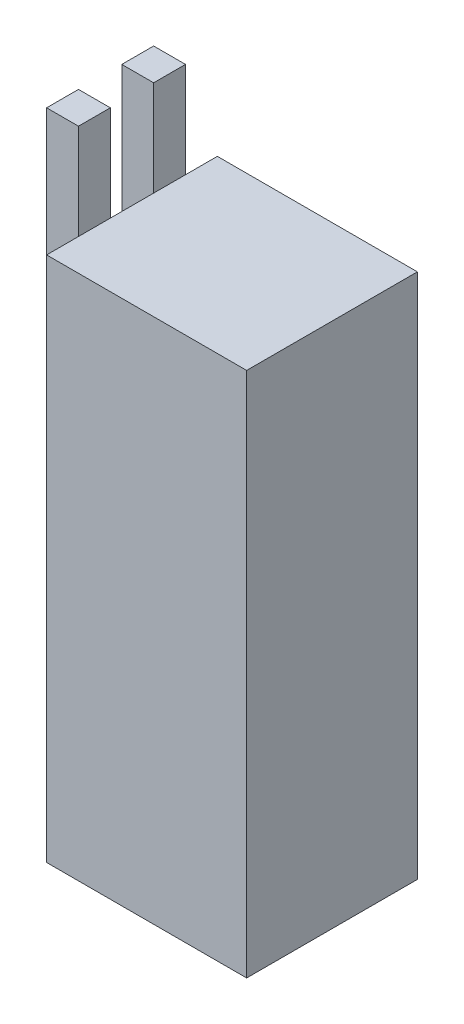
ISO-10303-21;
HEADER;
FILE_DESCRIPTION(('STEP AP214'),'2;1');
FILE_NAME('part.step','',(''),(''),'','','');
FILE_SCHEMA(('AUTOMOTIVE_DESIGN { 1 0 10303 214 1 1 1 1 }'));
ENDSEC;
DATA;
#1=APPLICATION_CONTEXT('core data for automotive mechanical design processes');
#2=APPLICATION_PROTOCOL_DEFINITION('international standard','automotive_design',2000,#1);
#3=PRODUCT_CONTEXT('',#1,'mechanical');
#4=PRODUCT('Part','Part','',(#3));
#5=PRODUCT_RELATED_PRODUCT_CATEGORY('part','',(#4));
#6=PRODUCT_DEFINITION_FORMATION('','',#4);
#7=PRODUCT_DEFINITION_CONTEXT('part definition',#1,'design');
#8=PRODUCT_DEFINITION('design','',#6,#7);
#9=PRODUCT_DEFINITION_SHAPE('','',#8);
#10=(LENGTH_UNIT() NAMED_UNIT(*) SI_UNIT(.MILLI.,.METRE.));
#11=(NAMED_UNIT(*) PLANE_ANGLE_UNIT() SI_UNIT($,.RADIAN.));
#12=(NAMED_UNIT(*) SI_UNIT($,.STERADIAN.) SOLID_ANGLE_UNIT());
#13=UNCERTAINTY_MEASURE_WITH_UNIT(LENGTH_MEASURE(1.E-05),#10,'distance_accuracy_value','');
#14=(GEOMETRIC_REPRESENTATION_CONTEXT(3) GLOBAL_UNCERTAINTY_ASSIGNED_CONTEXT((#13)) GLOBAL_UNIT_ASSIGNED_CONTEXT((#10,
#11,#12)) REPRESENTATION_CONTEXT('',''));
#15=CARTESIAN_POINT('',(0.,0.,0.));
#16=DIRECTION('',(0.,0.,1.));
#17=DIRECTION('',(1.,0.,0.));
#18=AXIS2_PLACEMENT_3D('',#15,#16,#17);
#19=CARTESIAN_POINT('',(19.939,104.902,17.018));
#20=DIRECTION('',(-1.,0.,0.));
#21=DIRECTION('',(0.,0.,1.));
#22=AXIS2_PLACEMENT_3D('',#19,#20,#21);
#23=PLANE('',#22);
#24=DIRECTION('',(0.,0.,-1.));
#25=VECTOR('',#24,1.);
#26=CARTESIAN_POINT('',(19.939,0.,17.018));
#27=LINE('',#26,#25);
#28=CARTESIAN_POINT('',(19.939,0.,17.018));
#29=VERTEX_POINT('',#28);
#30=CARTESIAN_POINT('',(19.939,0.,-17.018));
#31=VERTEX_POINT('',#30);
#32=EDGE_CURVE('E207',#29,#31,#27,.T.);
#33=ORIENTED_EDGE('',*,*,#32,.T.);
#34=DIRECTION('',(0.,-1.,0.));
#35=VECTOR('',#34,1.);
#36=CARTESIAN_POINT('',(19.939,104.902,-17.018));
#37=LINE('',#36,#35);
#38=CARTESIAN_POINT('',(19.939,104.902,-17.018));
#39=VERTEX_POINT('',#38);
#40=EDGE_CURVE('E38',#39,#31,#37,.T.);
#41=ORIENTED_EDGE('',*,*,#40,.F.);
#42=DIRECTION('',(0.,0.,-1.));
#43=VECTOR('',#42,1.);
#44=CARTESIAN_POINT('',(19.939,104.902,17.018));
#45=LINE('',#44,#43);
#46=CARTESIAN_POINT('',(19.939,104.902,17.018));
#47=VERTEX_POINT('',#46);
#48=EDGE_CURVE('E213',#47,#39,#45,.T.);
#49=ORIENTED_EDGE('',*,*,#48,.F.);
#50=DIRECTION('',(0.,-1.,0.));
#51=VECTOR('',#50,1.);
#52=CARTESIAN_POINT('',(19.939,104.902,17.018));
#53=LINE('',#52,#51);
#54=EDGE_CURVE('E226',#47,#29,#53,.T.);
#55=ORIENTED_EDGE('',*,*,#54,.T.);
#56=EDGE_LOOP('',(#33,#41,#49,#55));
#57=FACE_BOUND('',#56,.T.);
#58=ADVANCED_FACE('F35',(#57),#23,.F.);
#59=CARTESIAN_POINT('',(-19.939,104.902,-17.018));
#60=DIRECTION('',(0.,0.,1.));
#61=DIRECTION('',(1.,0.,0.));
#62=AXIS2_PLACEMENT_3D('',#59,#60,#61);
#63=PLANE('',#62);
#64=DIRECTION('',(-1.,0.,0.));
#65=VECTOR('',#64,1.);
#66=CARTESIAN_POINT('',(-19.939,0.,-17.018));
#67=LINE('',#66,#65);
#68=CARTESIAN_POINT('',(-19.939,0.,-17.018));
#69=VERTEX_POINT('',#68);
#70=EDGE_CURVE('E229',#31,#69,#67,.T.);
#71=ORIENTED_EDGE('',*,*,#70,.T.);
#72=DIRECTION('',(0.,-1.,0.));
#73=VECTOR('',#72,1.);
#74=CARTESIAN_POINT('',(-19.939,104.902,-17.018));
#75=LINE('',#74,#73);
#76=CARTESIAN_POINT('',(-19.939,104.902,-17.018));
#77=VERTEX_POINT('',#76);
#78=EDGE_CURVE('E238',#77,#69,#75,.T.);
#79=ORIENTED_EDGE('',*,*,#78,.F.);
#80=DIRECTION('',(-1.,0.,0.));
#81=VECTOR('',#80,1.);
#82=CARTESIAN_POINT('',(-19.939,104.902,-17.018));
#83=LINE('',#82,#81);
#84=EDGE_CURVE('E216',#39,#77,#83,.T.);
#85=ORIENTED_EDGE('',*,*,#84,.F.);
#86=ORIENTED_EDGE('',*,*,#40,.T.);
#87=EDGE_LOOP('',(#71,#79,#85,#86));
#88=FACE_BOUND('',#87,.T.);
#89=ADVANCED_FACE('F247',(#88),#63,.F.);
#90=CARTESIAN_POINT('',(-19.939,104.902,17.018));
#91=DIRECTION('',(1.,0.,0.));
#92=DIRECTION('',(0.,0.,-1.));
#93=AXIS2_PLACEMENT_3D('',#90,#91,#92);
#94=PLANE('',#93);
#95=DIRECTION('',(0.,0.,-1.));
#96=VECTOR('',#95,1.);
#97=CARTESIAN_POINT('',(-19.939,98.552,4.31799999999999));
#98=LINE('',#97,#96);
#99=CARTESIAN_POINT('',(-19.939,98.552,10.668));
#100=VERTEX_POINT('',#99);
#101=CARTESIAN_POINT('',(-19.939,98.552,4.31799999999999));
#102=VERTEX_POINT('',#101);
#103=EDGE_CURVE('E164',#100,#102,#98,.T.);
#104=ORIENTED_EDGE('',*,*,#103,.T.);
#105=DIRECTION('',(0.,1.,0.));
#106=VECTOR('',#105,1.);
#107=CARTESIAN_POINT('',(-19.939,98.552,4.31799999999999));
#108=LINE('',#107,#106);
#109=CARTESIAN_POINT('',(-19.939,104.902,4.31799999999999));
#110=VERTEX_POINT('',#109);
#111=EDGE_CURVE('E171',#102,#110,#108,.T.);
#112=ORIENTED_EDGE('',*,*,#111,.T.);
#113=DIRECTION('',(0.,0.,1.));
#114=VECTOR('',#113,1.);
#115=CARTESIAN_POINT('',(-19.939,104.902,17.018));
#116=LINE('',#115,#114);
#117=CARTESIAN_POINT('',(-19.939,104.902,-4.31800000000001));
#118=VERTEX_POINT('',#117);
#119=EDGE_CURVE('E267',#118,#110,#116,.T.);
#120=ORIENTED_EDGE('',*,*,#119,.F.);
#121=DIRECTION('',(0.,-1.,0.));
#122=VECTOR('',#121,1.);
#123=CARTESIAN_POINT('',(-19.939,98.552,-4.31800000000001));
#124=LINE('',#123,#122);
#125=CARTESIAN_POINT('',(-19.939,98.552,-4.31800000000001));
#126=VERTEX_POINT('',#125);
#127=EDGE_CURVE('E11',#118,#126,#124,.T.);
#128=ORIENTED_EDGE('',*,*,#127,.T.);
#129=DIRECTION('',(0.,0.,-1.));
#130=VECTOR('',#129,1.);
#131=CARTESIAN_POINT('',(-19.939,98.552,-4.31800000000001));
#132=LINE('',#131,#130);
#133=CARTESIAN_POINT('',(-19.939,98.552,-10.668));
#134=VERTEX_POINT('',#133);
#135=EDGE_CURVE('E197',#126,#134,#132,.T.);
#136=ORIENTED_EDGE('',*,*,#135,.T.);
#137=DIRECTION('',(0.,1.,0.));
#138=VECTOR('',#137,1.);
#139=CARTESIAN_POINT('',(-19.939,98.552,-10.668));
#140=LINE('',#139,#138);
#141=CARTESIAN_POINT('',(-19.939,104.902,-10.668));
#142=VERTEX_POINT('',#141);
#143=EDGE_CURVE('E200',#134,#142,#140,.T.);
#144=ORIENTED_EDGE('',*,*,#143,.T.);
#145=EDGE_CURVE('E220',#77,#142,#116,.T.);
#146=ORIENTED_EDGE('',*,*,#145,.F.);
#147=ORIENTED_EDGE('',*,*,#78,.T.);
#148=DIRECTION('',(0.,0.,1.));
#149=VECTOR('',#148,1.);
#150=CARTESIAN_POINT('',(-19.939,0.,17.018));
#151=LINE('',#150,#149);
#152=CARTESIAN_POINT('',(-19.939,0.,17.018));
#153=VERTEX_POINT('',#152);
#154=EDGE_CURVE('E231',#69,#153,#151,.T.);
#155=ORIENTED_EDGE('',*,*,#154,.T.);
#156=DIRECTION('',(0.,-1.,0.));
#157=VECTOR('',#156,1.);
#158=CARTESIAN_POINT('',(-19.939,104.902,17.018));
#159=LINE('',#158,#157);
#160=CARTESIAN_POINT('',(-19.939,104.902,17.018));
#161=VERTEX_POINT('',#160);
#162=EDGE_CURVE('E236',#161,#153,#159,.T.);
#163=ORIENTED_EDGE('',*,*,#162,.F.);
#164=CARTESIAN_POINT('',(-19.939,104.902,10.668));
#165=VERTEX_POINT('',#164);
#166=EDGE_CURVE('E219',#165,#161,#116,.T.);
#167=ORIENTED_EDGE('',*,*,#166,.F.);
#168=DIRECTION('',(0.,-1.,0.));
#169=VECTOR('',#168,1.);
#170=CARTESIAN_POINT('',(-19.939,98.552,10.668));
#171=LINE('',#170,#169);
#172=EDGE_CURVE('E176',#165,#100,#171,.T.);
#173=ORIENTED_EDGE('',*,*,#172,.T.);
#174=EDGE_LOOP('',(#104,#112,#120,#128,#136,#144,#146,#147,#155,#163,#167,#173));
#175=FACE_BOUND('',#174,.T.);
#176=ADVANCED_FACE('F256',(#175),#94,.F.);
#177=CARTESIAN_POINT('',(-19.939,104.902,17.018));
#178=DIRECTION('',(0.,0.,-1.));
#179=DIRECTION('',(-1.,0.,0.));
#180=AXIS2_PLACEMENT_3D('',#177,#178,#179);
#181=PLANE('',#180);
#182=DIRECTION('',(1.,0.,0.));
#183=VECTOR('',#182,1.);
#184=CARTESIAN_POINT('',(-19.939,0.,17.018));
#185=LINE('',#184,#183);
#186=EDGE_CURVE('E217',#153,#29,#185,.T.);
#187=ORIENTED_EDGE('',*,*,#186,.T.);
#188=ORIENTED_EDGE('',*,*,#54,.F.);
#189=DIRECTION('',(1.,0.,0.));
#190=VECTOR('',#189,1.);
#191=CARTESIAN_POINT('',(-19.939,104.902,17.018));
#192=LINE('',#191,#190);
#193=EDGE_CURVE('E223',#161,#47,#192,.T.);
#194=ORIENTED_EDGE('',*,*,#193,.F.);
#195=ORIENTED_EDGE('',*,*,#162,.T.);
#196=EDGE_LOOP('',(#187,#188,#194,#195));
#197=FACE_BOUND('',#196,.T.);
#198=ADVANCED_FACE('F260',(#197),#181,.F.);
#199=CARTESIAN_POINT('',(0.,104.902,0.));
#200=DIRECTION('',(0.,-1.,0.));
#201=DIRECTION('',(0.,0.,-1.));
#202=AXIS2_PLACEMENT_3D('',#199,#200,#201);
#203=PLANE('',#202);
#204=ORIENTED_EDGE('',*,*,#48,.T.);
#205=ORIENTED_EDGE('',*,*,#84,.T.);
#206=ORIENTED_EDGE('',*,*,#145,.T.);
#207=EDGE_CURVE('E224',#142,#118,#116,.T.);
#208=ORIENTED_EDGE('',*,*,#207,.T.);
#209=ORIENTED_EDGE('',*,*,#119,.T.);
#210=EDGE_CURVE('E265',#110,#165,#116,.T.);
#211=ORIENTED_EDGE('',*,*,#210,.T.);
#212=ORIENTED_EDGE('',*,*,#166,.T.);
#213=ORIENTED_EDGE('',*,*,#193,.T.);
#214=EDGE_LOOP('',(#204,#205,#206,#208,#209,#211,#212,#213));
#215=FACE_BOUND('',#214,.T.);
#216=ADVANCED_FACE('F262',(#215),#203,.F.);
#217=CARTESIAN_POINT('',(0.,0.,0.));
#218=DIRECTION('',(0.,-1.,0.));
#219=DIRECTION('',(0.,0.,-1.));
#220=AXIS2_PLACEMENT_3D('',#217,#218,#219);
#221=PLANE('',#220);
#222=ORIENTED_EDGE('',*,*,#32,.F.);
#223=ORIENTED_EDGE('',*,*,#186,.F.);
#224=ORIENTED_EDGE('',*,*,#154,.F.);
#225=ORIENTED_EDGE('',*,*,#70,.F.);
#226=EDGE_LOOP('',(#222,#223,#224,#225));
#227=FACE_BOUND('',#226,.T.);
#228=ADVANCED_FACE('F254',(#227),#221,.T.);
#229=CARTESIAN_POINT('',(-26.289,98.552,-4.31800000000001));
#230=DIRECTION('',(0.,0.,1.));
#231=DIRECTION('',(1.,0.,0.));
#232=AXIS2_PLACEMENT_3D('',#229,#230,#231);
#233=PLANE('',#232);
#234=CARTESIAN_POINT('',(-19.939,123.952,-4.31800000000001));
#235=VERTEX_POINT('',#234);
#236=EDGE_CURVE('E44',#235,#118,#124,.T.);
#237=ORIENTED_EDGE('',*,*,#236,.F.);
#238=DIRECTION('',(1.,0.,0.));
#239=VECTOR('',#238,1.);
#240=CARTESIAN_POINT('',(-26.289,123.952,-4.31800000000001));
#241=LINE('',#240,#239);
#242=CARTESIAN_POINT('',(-26.289,123.952,-4.31800000000001));
#243=VERTEX_POINT('',#242);
#244=EDGE_CURVE('E205',#243,#235,#241,.T.);
#245=ORIENTED_EDGE('',*,*,#244,.F.);
#246=DIRECTION('',(0.,-1.,0.));
#247=VECTOR('',#246,1.);
#248=CARTESIAN_POINT('',(-26.289,98.552,-4.31800000000001));
#249=LINE('',#248,#247);
#250=CARTESIAN_POINT('',(-26.289,98.552,-4.31800000000001));
#251=VERTEX_POINT('',#250);
#252=EDGE_CURVE('E182',#243,#251,#249,.T.);
#253=ORIENTED_EDGE('',*,*,#252,.T.);
#254=DIRECTION('',(1.,0.,0.));
#255=VECTOR('',#254,1.);
#256=CARTESIAN_POINT('',(-26.289,98.552,-4.31800000000001));
#257=LINE('',#256,#255);
#258=EDGE_CURVE('E194',#251,#126,#257,.T.);
#259=ORIENTED_EDGE('',*,*,#258,.T.);
#260=ORIENTED_EDGE('',*,*,#127,.F.);
#261=EDGE_LOOP('',(#237,#245,#253,#259,#260));
#262=FACE_BOUND('',#261,.T.);
#263=ADVANCED_FACE('F284',(#262),#233,.T.);
#264=CARTESIAN_POINT('',(-26.289,123.952,-4.31800000000001));
#265=DIRECTION('',(0.,1.,0.));
#266=DIRECTION('',(0.,0.,1.));
#267=AXIS2_PLACEMENT_3D('',#264,#265,#266);
#268=PLANE('',#267);
#269=DIRECTION('',(0.,0.,1.));
#270=VECTOR('',#269,1.);
#271=CARTESIAN_POINT('',(-19.939,123.952,-4.31800000000001));
#272=LINE('',#271,#270);
#273=CARTESIAN_POINT('',(-19.939,123.952,-10.668));
#274=VERTEX_POINT('',#273);
#275=EDGE_CURVE('E186',#274,#235,#272,.T.);
#276=ORIENTED_EDGE('',*,*,#275,.F.);
#277=DIRECTION('',(1.,0.,0.));
#278=VECTOR('',#277,1.);
#279=CARTESIAN_POINT('',(-26.289,123.952,-10.668));
#280=LINE('',#279,#278);
#281=CARTESIAN_POINT('',(-26.289,123.952,-10.668));
#282=VERTEX_POINT('',#281);
#283=EDGE_CURVE('E208',#282,#274,#280,.T.);
#284=ORIENTED_EDGE('',*,*,#283,.F.);
#285=DIRECTION('',(0.,0.,1.));
#286=VECTOR('',#285,1.);
#287=CARTESIAN_POINT('',(-26.289,123.952,-4.31800000000001));
#288=LINE('',#287,#286);
#289=EDGE_CURVE('E192',#282,#243,#288,.T.);
#290=ORIENTED_EDGE('',*,*,#289,.T.);
#291=ORIENTED_EDGE('',*,*,#244,.T.);
#292=EDGE_LOOP('',(#276,#284,#290,#291));
#293=FACE_BOUND('',#292,.T.);
#294=ADVANCED_FACE('F287',(#293),#268,.T.);
#295=CARTESIAN_POINT('',(-26.289,98.552,-10.668));
#296=DIRECTION('',(0.,0.,-1.));
#297=DIRECTION('',(0.,1.,0.));
#298=AXIS2_PLACEMENT_3D('',#295,#296,#297);
#299=PLANE('',#298);
#300=ORIENTED_EDGE('',*,*,#143,.F.);
#301=DIRECTION('',(1.,0.,0.));
#302=VECTOR('',#301,1.);
#303=CARTESIAN_POINT('',(-26.289,98.552,-10.668));
#304=LINE('',#303,#302);
#305=CARTESIAN_POINT('',(-26.289,98.552,-10.668));
#306=VERTEX_POINT('',#305);
#307=EDGE_CURVE('E210',#306,#134,#304,.T.);
#308=ORIENTED_EDGE('',*,*,#307,.F.);
#309=DIRECTION('',(0.,1.,0.));
#310=VECTOR('',#309,1.);
#311=CARTESIAN_POINT('',(-26.289,98.552,-10.668));
#312=LINE('',#311,#310);
#313=EDGE_CURVE('E189',#306,#282,#312,.T.);
#314=ORIENTED_EDGE('',*,*,#313,.T.);
#315=ORIENTED_EDGE('',*,*,#283,.T.);
#316=EDGE_CURVE('E59',#142,#274,#140,.T.);
#317=ORIENTED_EDGE('',*,*,#316,.F.);
#318=EDGE_LOOP('',(#300,#308,#314,#315,#317));
#319=FACE_BOUND('',#318,.T.);
#320=ADVANCED_FACE('F274',(#319),#299,.T.);
#321=CARTESIAN_POINT('',(-26.289,98.552,-4.31800000000001));
#322=DIRECTION('',(0.,-1.,0.));
#323=DIRECTION('',(0.,0.,-1.));
#324=AXIS2_PLACEMENT_3D('',#321,#322,#323);
#325=PLANE('',#324);
#326=ORIENTED_EDGE('',*,*,#135,.F.);
#327=ORIENTED_EDGE('',*,*,#258,.F.);
#328=DIRECTION('',(0.,0.,-1.));
#329=VECTOR('',#328,1.);
#330=CARTESIAN_POINT('',(-26.289,98.552,-4.31800000000001));
#331=LINE('',#330,#329);
#332=EDGE_CURVE('E185',#251,#306,#331,.T.);
#333=ORIENTED_EDGE('',*,*,#332,.T.);
#334=ORIENTED_EDGE('',*,*,#307,.T.);
#335=EDGE_LOOP('',(#326,#327,#333,#334));
#336=FACE_BOUND('',#335,.T.);
#337=ADVANCED_FACE('F282',(#336),#325,.T.);
#338=CARTESIAN_POINT('',(-26.289,0.,0.));
#339=DIRECTION('',(-1.,0.,0.));
#340=DIRECTION('',(0.,0.,1.));
#341=AXIS2_PLACEMENT_3D('',#338,#339,#340);
#342=PLANE('',#341);
#343=ORIENTED_EDGE('',*,*,#252,.F.);
#344=ORIENTED_EDGE('',*,*,#289,.F.);
#345=ORIENTED_EDGE('',*,*,#313,.F.);
#346=ORIENTED_EDGE('',*,*,#332,.F.);
#347=EDGE_LOOP('',(#343,#344,#345,#346));
#348=FACE_BOUND('',#347,.T.);
#349=ADVANCED_FACE('F281',(#348),#342,.T.);
#350=CARTESIAN_POINT('',(-19.939,0.,0.));
#351=DIRECTION('',(-1.,0.,0.));
#352=DIRECTION('',(0.,0.,1.));
#353=AXIS2_PLACEMENT_3D('',#350,#351,#352);
#354=PLANE('',#353);
#355=ORIENTED_EDGE('',*,*,#207,.F.);
#356=ORIENTED_EDGE('',*,*,#316,.T.);
#357=ORIENTED_EDGE('',*,*,#275,.T.);
#358=ORIENTED_EDGE('',*,*,#236,.T.);
#359=EDGE_LOOP('',(#355,#356,#357,#358));
#360=FACE_BOUND('',#359,.T.);
#361=ADVANCED_FACE('F271',(#360),#354,.F.);
#362=CARTESIAN_POINT('',(-19.939,0.,0.));
#363=DIRECTION('',(1.,0.,0.));
#364=DIRECTION('',(0.,0.,-1.));
#365=AXIS2_PLACEMENT_3D('',#362,#363,#364);
#366=PLANE('',#365);
#367=ORIENTED_EDGE('',*,*,#210,.F.);
#368=CARTESIAN_POINT('',(-19.939,123.952,4.31799999999999));
#369=VERTEX_POINT('',#368);
#370=EDGE_CURVE('E174',#110,#369,#108,.T.);
#371=ORIENTED_EDGE('',*,*,#370,.T.);
#372=DIRECTION('',(0.,0.,1.));
#373=VECTOR('',#372,1.);
#374=CARTESIAN_POINT('',(-19.939,123.952,4.31799999999999));
#375=LINE('',#374,#373);
#376=CARTESIAN_POINT('',(-19.939,123.952,10.668));
#377=VERTEX_POINT('',#376);
#378=EDGE_CURVE('E144',#369,#377,#375,.T.);
#379=ORIENTED_EDGE('',*,*,#378,.T.);
#380=EDGE_CURVE('E51',#377,#165,#171,.T.);
#381=ORIENTED_EDGE('',*,*,#380,.T.);
#382=EDGE_LOOP('',(#367,#371,#379,#381));
#383=FACE_BOUND('',#382,.T.);
#384=ADVANCED_FACE('F320',(#383),#366,.T.);
#385=CARTESIAN_POINT('',(-26.289,98.552,4.31799999999999));
#386=DIRECTION('',(0.,0.,-1.));
#387=DIRECTION('',(0.,1.,0.));
#388=AXIS2_PLACEMENT_3D('',#385,#386,#387);
#389=PLANE('',#388);
#390=ORIENTED_EDGE('',*,*,#111,.F.);
#391=DIRECTION('',(1.,0.,0.));
#392=VECTOR('',#391,1.);
#393=CARTESIAN_POINT('',(-26.289,98.552,4.31799999999999));
#394=LINE('',#393,#392);
#395=CARTESIAN_POINT('',(-26.289,98.552,4.31799999999999));
#396=VERTEX_POINT('',#395);
#397=EDGE_CURVE('E163',#396,#102,#394,.T.);
#398=ORIENTED_EDGE('',*,*,#397,.F.);
#399=DIRECTION('',(0.,1.,0.));
#400=VECTOR('',#399,1.);
#401=CARTESIAN_POINT('',(-26.289,98.552,4.31799999999999));
#402=LINE('',#401,#400);
#403=CARTESIAN_POINT('',(-26.289,123.952,4.31799999999999));
#404=VERTEX_POINT('',#403);
#405=EDGE_CURVE('E156',#396,#404,#402,.T.);
#406=ORIENTED_EDGE('',*,*,#405,.T.);
#407=DIRECTION('',(1.,0.,0.));
#408=VECTOR('',#407,1.);
#409=CARTESIAN_POINT('',(-26.289,123.952,4.31799999999999));
#410=LINE('',#409,#408);
#411=EDGE_CURVE('E140',#404,#369,#410,.T.);
#412=ORIENTED_EDGE('',*,*,#411,.T.);
#413=ORIENTED_EDGE('',*,*,#370,.F.);
#414=EDGE_LOOP('',(#390,#398,#406,#412,#413));
#415=FACE_BOUND('',#414,.T.);
#416=ADVANCED_FACE('F162',(#415),#389,.T.);
#417=CARTESIAN_POINT('',(-26.289,98.552,4.31799999999999));
#418=DIRECTION('',(0.,-1.,0.));
#419=DIRECTION('',(0.,0.,-1.));
#420=AXIS2_PLACEMENT_3D('',#417,#418,#419);
#421=PLANE('',#420);
#422=ORIENTED_EDGE('',*,*,#103,.F.);
#423=DIRECTION('',(1.,0.,0.));
#424=VECTOR('',#423,1.);
#425=CARTESIAN_POINT('',(-26.289,98.552,10.668));
#426=LINE('',#425,#424);
#427=CARTESIAN_POINT('',(-26.289,98.552,10.668));
#428=VERTEX_POINT('',#427);
#429=EDGE_CURVE('E179',#428,#100,#426,.T.);
#430=ORIENTED_EDGE('',*,*,#429,.F.);
#431=DIRECTION('',(0.,0.,-1.));
#432=VECTOR('',#431,1.);
#433=CARTESIAN_POINT('',(-26.289,98.552,4.31799999999999));
#434=LINE('',#433,#432);
#435=EDGE_CURVE('E149',#428,#396,#434,.T.);
#436=ORIENTED_EDGE('',*,*,#435,.T.);
#437=ORIENTED_EDGE('',*,*,#397,.T.);
#438=EDGE_LOOP('',(#422,#430,#436,#437));
#439=FACE_BOUND('',#438,.T.);
#440=ADVANCED_FACE('F324',(#439),#421,.T.);
#441=CARTESIAN_POINT('',(-26.289,98.552,10.668));
#442=DIRECTION('',(0.,0.,1.));
#443=DIRECTION('',(0.,-1.,0.));
#444=AXIS2_PLACEMENT_3D('',#441,#442,#443);
#445=PLANE('',#444);
#446=ORIENTED_EDGE('',*,*,#380,.F.);
#447=DIRECTION('',(1.,0.,0.));
#448=VECTOR('',#447,1.);
#449=CARTESIAN_POINT('',(-26.289,123.952,10.668));
#450=LINE('',#449,#448);
#451=CARTESIAN_POINT('',(-26.289,123.952,10.668));
#452=VERTEX_POINT('',#451);
#453=EDGE_CURVE('E148',#452,#377,#450,.T.);
#454=ORIENTED_EDGE('',*,*,#453,.F.);
#455=DIRECTION('',(0.,-1.,0.));
#456=VECTOR('',#455,1.);
#457=CARTESIAN_POINT('',(-26.289,98.552,10.668));
#458=LINE('',#457,#456);
#459=EDGE_CURVE('E159',#452,#428,#458,.T.);
#460=ORIENTED_EDGE('',*,*,#459,.T.);
#461=ORIENTED_EDGE('',*,*,#429,.T.);
#462=ORIENTED_EDGE('',*,*,#172,.F.);
#463=EDGE_LOOP('',(#446,#454,#460,#461,#462));
#464=FACE_BOUND('',#463,.T.);
#465=ADVANCED_FACE('F327',(#464),#445,.T.);
#466=CARTESIAN_POINT('',(-26.289,123.952,4.31799999999999));
#467=DIRECTION('',(0.,1.,0.));
#468=DIRECTION('',(0.,0.,1.));
#469=AXIS2_PLACEMENT_3D('',#466,#467,#468);
#470=PLANE('',#469);
#471=ORIENTED_EDGE('',*,*,#378,.F.);
#472=ORIENTED_EDGE('',*,*,#411,.F.);
#473=DIRECTION('',(0.,0.,1.));
#474=VECTOR('',#473,1.);
#475=CARTESIAN_POINT('',(-26.289,123.952,4.31799999999999));
#476=LINE('',#475,#474);
#477=EDGE_CURVE('E143',#404,#452,#476,.T.);
#478=ORIENTED_EDGE('',*,*,#477,.T.);
#479=ORIENTED_EDGE('',*,*,#453,.T.);
#480=EDGE_LOOP('',(#471,#472,#478,#479));
#481=FACE_BOUND('',#480,.T.);
#482=ADVANCED_FACE('F142',(#481),#470,.T.);
#483=CARTESIAN_POINT('',(-26.289,0.,0.));
#484=DIRECTION('',(1.,0.,0.));
#485=DIRECTION('',(0.,0.,-1.));
#486=AXIS2_PLACEMENT_3D('',#483,#484,#485);
#487=PLANE('',#486);
#488=ORIENTED_EDGE('',*,*,#405,.F.);
#489=ORIENTED_EDGE('',*,*,#435,.F.);
#490=ORIENTED_EDGE('',*,*,#459,.F.);
#491=ORIENTED_EDGE('',*,*,#477,.F.);
#492=EDGE_LOOP('',(#488,#489,#490,#491));
#493=FACE_BOUND('',#492,.T.);
#494=ADVANCED_FACE('F154',(#493),#487,.F.);
#495=CLOSED_SHELL('',(#58,#89,#176,#198,#216,#228,#263,#294,#320,#337,#349,#361,#384,#416,#440,
#465,#482,#494));
#496=MANIFOLD_SOLID_BREP('B2',#495);
#497=ADVANCED_BREP_SHAPE_REPRESENTATION('',(#18,#496),#14);
#498=SHAPE_DEFINITION_REPRESENTATION(#9,#497);
ENDSEC;
END-ISO-10303-21;
